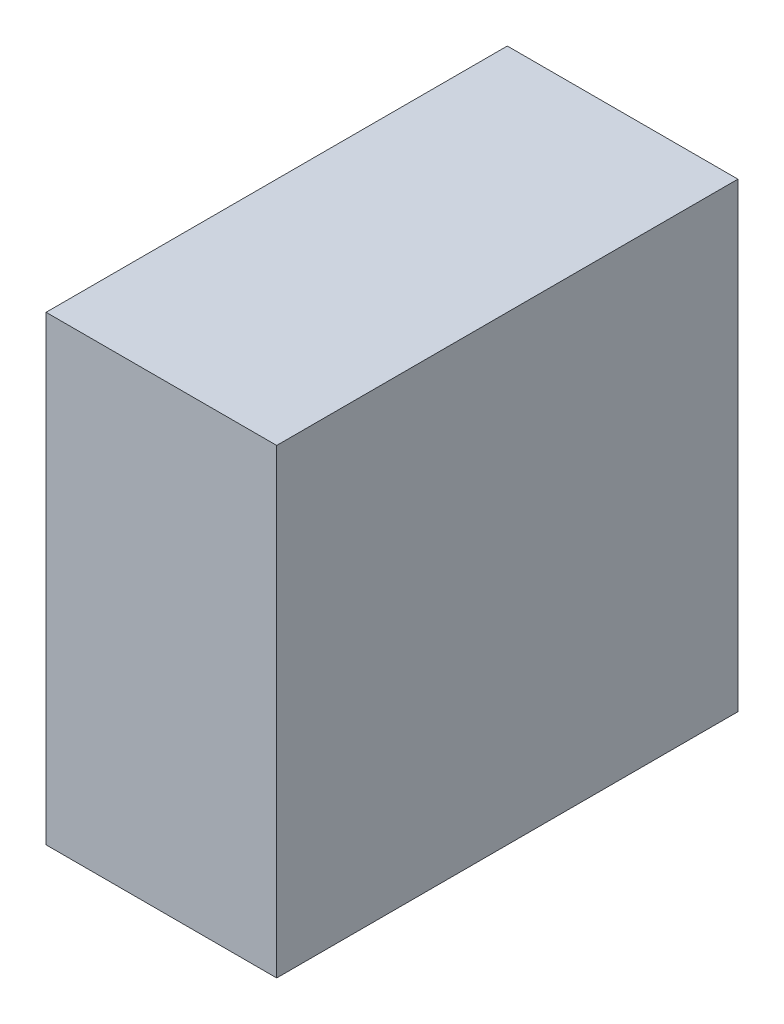
ISO-10303-21;
HEADER;
FILE_DESCRIPTION(('STEP AP214'),'2;1');
FILE_NAME('part.step','',(''),(''),'','','');
FILE_SCHEMA(('AUTOMOTIVE_DESIGN { 1 0 10303 214 1 1 1 1 }'));
ENDSEC;
DATA;
#1=APPLICATION_CONTEXT('core data for automotive mechanical design processes');
#2=APPLICATION_PROTOCOL_DEFINITION('international standard','automotive_design',2000,#1);
#3=PRODUCT_CONTEXT('',#1,'mechanical');
#4=PRODUCT('Part','Part','',(#3));
#5=PRODUCT_RELATED_PRODUCT_CATEGORY('part','',(#4));
#6=PRODUCT_DEFINITION_FORMATION('','',#4);
#7=PRODUCT_DEFINITION_CONTEXT('part definition',#1,'design');
#8=PRODUCT_DEFINITION('design','',#6,#7);
#9=PRODUCT_DEFINITION_SHAPE('','',#8);
#10=(LENGTH_UNIT() NAMED_UNIT(*) SI_UNIT(.MILLI.,.METRE.));
#11=(NAMED_UNIT(*) PLANE_ANGLE_UNIT() SI_UNIT($,.RADIAN.));
#12=(NAMED_UNIT(*) SI_UNIT($,.STERADIAN.) SOLID_ANGLE_UNIT());
#13=UNCERTAINTY_MEASURE_WITH_UNIT(LENGTH_MEASURE(1.E-05),#10,'distance_accuracy_value','');
#14=(GEOMETRIC_REPRESENTATION_CONTEXT(3) GLOBAL_UNCERTAINTY_ASSIGNED_CONTEXT((#13)) GLOBAL_UNIT_ASSIGNED_CONTEXT((#10,
#11,#12)) REPRESENTATION_CONTEXT('',''));
#15=CARTESIAN_POINT('',(0.,0.,0.));
#16=DIRECTION('',(0.,0.,1.));
#17=DIRECTION('',(1.,0.,0.));
#18=AXIS2_PLACEMENT_3D('',#15,#16,#17);
#19=CARTESIAN_POINT('',(15.,60.,30.));
#20=DIRECTION('',(-1.,0.,0.));
#21=DIRECTION('',(0.,0.,1.));
#22=AXIS2_PLACEMENT_3D('',#19,#20,#21);
#23=PLANE('',#22);
#24=DIRECTION('',(0.,0.,-1.));
#25=VECTOR('',#24,1.);
#26=CARTESIAN_POINT('',(15.,0.,30.));
#27=LINE('',#26,#25);
#28=CARTESIAN_POINT('',(15.,0.,30.));
#29=VERTEX_POINT('',#28);
#30=CARTESIAN_POINT('',(15.,0.,-30.));
#31=VERTEX_POINT('',#30);
#32=EDGE_CURVE('E96',#29,#31,#27,.T.);
#33=ORIENTED_EDGE('',*,*,#32,.T.);
#34=DIRECTION('',(0.,-1.,0.));
#35=VECTOR('',#34,1.);
#36=CARTESIAN_POINT('',(15.,60.,-30.));
#37=LINE('',#36,#35);
#38=CARTESIAN_POINT('',(15.,60.,-30.));
#39=VERTEX_POINT('',#38);
#40=EDGE_CURVE('E11',#39,#31,#37,.T.);
#41=ORIENTED_EDGE('',*,*,#40,.F.);
#42=DIRECTION('',(0.,0.,-1.));
#43=VECTOR('',#42,1.);
#44=CARTESIAN_POINT('',(15.,60.,30.));
#45=LINE('',#44,#43);
#46=CARTESIAN_POINT('',(15.,60.,30.));
#47=VERTEX_POINT('',#46);
#48=EDGE_CURVE('E84',#47,#39,#45,.T.);
#49=ORIENTED_EDGE('',*,*,#48,.F.);
#50=DIRECTION('',(0.,-1.,0.));
#51=VECTOR('',#50,1.);
#52=CARTESIAN_POINT('',(15.,60.,30.));
#53=LINE('',#52,#51);
#54=EDGE_CURVE('E92',#47,#29,#53,.T.);
#55=ORIENTED_EDGE('',*,*,#54,.T.);
#56=EDGE_LOOP('',(#33,#41,#49,#55));
#57=FACE_BOUND('',#56,.T.);
#58=ADVANCED_FACE('F33',(#57),#23,.F.);
#59=CARTESIAN_POINT('',(-15.,60.,-30.));
#60=DIRECTION('',(0.,0.,1.));
#61=DIRECTION('',(1.,0.,0.));
#62=AXIS2_PLACEMENT_3D('',#59,#60,#61);
#63=PLANE('',#62);
#64=DIRECTION('',(-1.,0.,0.));
#65=VECTOR('',#64,1.);
#66=CARTESIAN_POINT('',(-15.,0.,-30.));
#67=LINE('',#66,#65);
#68=CARTESIAN_POINT('',(-15.,0.,-30.));
#69=VERTEX_POINT('',#68);
#70=EDGE_CURVE('E88',#31,#69,#67,.T.);
#71=ORIENTED_EDGE('',*,*,#70,.T.);
#72=DIRECTION('',(0.,-1.,0.));
#73=VECTOR('',#72,1.);
#74=CARTESIAN_POINT('',(-15.,60.,-30.));
#75=LINE('',#74,#73);
#76=CARTESIAN_POINT('',(-15.,60.,-30.));
#77=VERTEX_POINT('',#76);
#78=EDGE_CURVE('E41',#77,#69,#75,.T.);
#79=ORIENTED_EDGE('',*,*,#78,.F.);
#80=DIRECTION('',(-1.,0.,0.));
#81=VECTOR('',#80,1.);
#82=CARTESIAN_POINT('',(-15.,60.,-30.));
#83=LINE('',#82,#81);
#84=EDGE_CURVE('E79',#39,#77,#83,.T.);
#85=ORIENTED_EDGE('',*,*,#84,.F.);
#86=ORIENTED_EDGE('',*,*,#40,.T.);
#87=EDGE_LOOP('',(#71,#79,#85,#86));
#88=FACE_BOUND('',#87,.T.);
#89=ADVANCED_FACE('F87',(#88),#63,.F.);
#90=CARTESIAN_POINT('',(-15.,60.,30.));
#91=DIRECTION('',(1.,0.,0.));
#92=DIRECTION('',(0.,0.,-1.));
#93=AXIS2_PLACEMENT_3D('',#90,#91,#92);
#94=PLANE('',#93);
#95=DIRECTION('',(0.,0.,1.));
#96=VECTOR('',#95,1.);
#97=CARTESIAN_POINT('',(-15.,0.,30.));
#98=LINE('',#97,#96);
#99=CARTESIAN_POINT('',(-15.,0.,30.));
#100=VERTEX_POINT('',#99);
#101=EDGE_CURVE('E66',#69,#100,#98,.T.);
#102=ORIENTED_EDGE('',*,*,#101,.T.);
#103=DIRECTION('',(0.,-1.,0.));
#104=VECTOR('',#103,1.);
#105=CARTESIAN_POINT('',(-15.,60.,30.));
#106=LINE('',#105,#104);
#107=CARTESIAN_POINT('',(-15.,60.,30.));
#108=VERTEX_POINT('',#107);
#109=EDGE_CURVE('E89',#108,#100,#106,.T.);
#110=ORIENTED_EDGE('',*,*,#109,.F.);
#111=DIRECTION('',(0.,0.,1.));
#112=VECTOR('',#111,1.);
#113=CARTESIAN_POINT('',(-15.,60.,30.));
#114=LINE('',#113,#112);
#115=EDGE_CURVE('E82',#77,#108,#114,.T.);
#116=ORIENTED_EDGE('',*,*,#115,.F.);
#117=ORIENTED_EDGE('',*,*,#78,.T.);
#118=EDGE_LOOP('',(#102,#110,#116,#117));
#119=FACE_BOUND('',#118,.T.);
#120=ADVANCED_FACE('F90',(#119),#94,.F.);
#121=CARTESIAN_POINT('',(-15.,60.,30.));
#122=DIRECTION('',(0.,0.,-1.));
#123=DIRECTION('',(-1.,0.,0.));
#124=AXIS2_PLACEMENT_3D('',#121,#122,#123);
#125=PLANE('',#124);
#126=DIRECTION('',(1.,0.,0.));
#127=VECTOR('',#126,1.);
#128=CARTESIAN_POINT('',(-15.,0.,30.));
#129=LINE('',#128,#127);
#130=EDGE_CURVE('E72',#100,#29,#129,.T.);
#131=ORIENTED_EDGE('',*,*,#130,.T.);
#132=ORIENTED_EDGE('',*,*,#54,.F.);
#133=DIRECTION('',(1.,0.,0.));
#134=VECTOR('',#133,1.);
#135=CARTESIAN_POINT('',(-15.,60.,30.));
#136=LINE('',#135,#134);
#137=EDGE_CURVE('E49',#108,#47,#136,.T.);
#138=ORIENTED_EDGE('',*,*,#137,.F.);
#139=ORIENTED_EDGE('',*,*,#109,.T.);
#140=EDGE_LOOP('',(#131,#132,#138,#139));
#141=FACE_BOUND('',#140,.T.);
#142=ADVANCED_FACE('F103',(#141),#125,.F.);
#143=CARTESIAN_POINT('',(0.,60.,0.));
#144=DIRECTION('',(0.,-1.,0.));
#145=DIRECTION('',(0.,0.,-1.));
#146=AXIS2_PLACEMENT_3D('',#143,#144,#145);
#147=PLANE('',#146);
#148=ORIENTED_EDGE('',*,*,#48,.T.);
#149=ORIENTED_EDGE('',*,*,#84,.T.);
#150=ORIENTED_EDGE('',*,*,#115,.T.);
#151=ORIENTED_EDGE('',*,*,#137,.T.);
#152=EDGE_LOOP('',(#148,#149,#150,#151));
#153=FACE_BOUND('',#152,.T.);
#154=ADVANCED_FACE('F80',(#153),#147,.F.);
#155=CARTESIAN_POINT('',(0.,0.,0.));
#156=DIRECTION('',(0.,-1.,0.));
#157=DIRECTION('',(0.,0.,-1.));
#158=AXIS2_PLACEMENT_3D('',#155,#156,#157);
#159=PLANE('',#158);
#160=ORIENTED_EDGE('',*,*,#32,.F.);
#161=ORIENTED_EDGE('',*,*,#130,.F.);
#162=ORIENTED_EDGE('',*,*,#101,.F.);
#163=ORIENTED_EDGE('',*,*,#70,.F.);
#164=EDGE_LOOP('',(#160,#161,#162,#163));
#165=FACE_BOUND('',#164,.T.);
#166=ADVANCED_FACE('F106',(#165),#159,.T.);
#167=CLOSED_SHELL('',(#58,#89,#120,#142,#154,#166));
#168=MANIFOLD_SOLID_BREP('B2',#167);
#169=ADVANCED_BREP_SHAPE_REPRESENTATION('',(#18,#168),#14);
#170=SHAPE_DEFINITION_REPRESENTATION(#9,#169);
ENDSEC;
END-ISO-10303-21;
